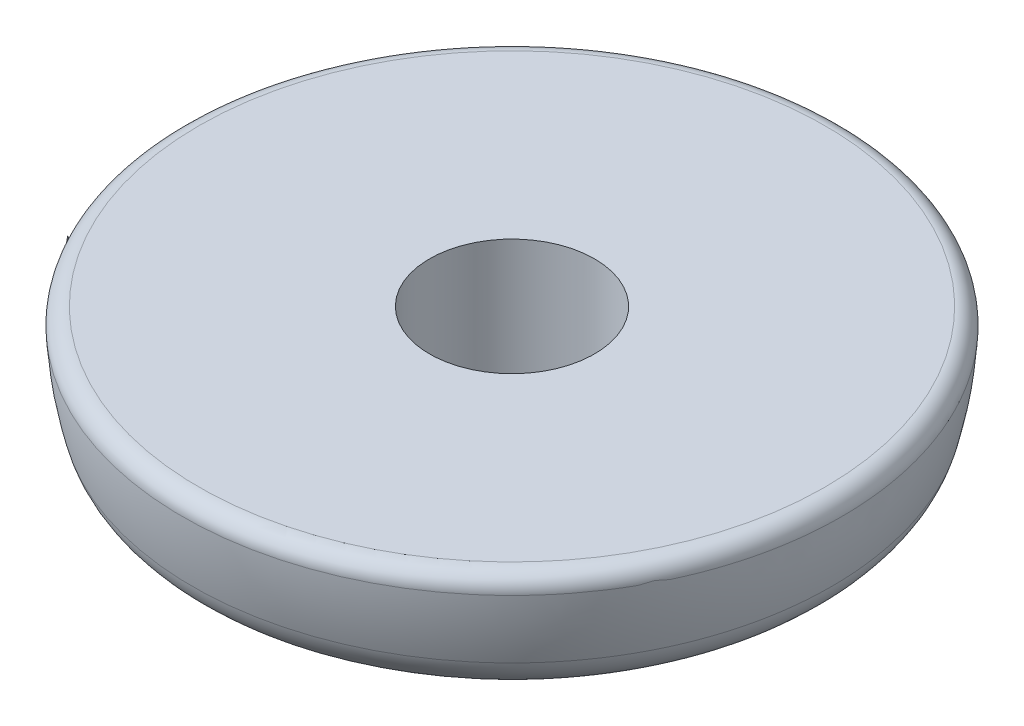
ISO-10303-21;
HEADER;
FILE_DESCRIPTION(('STEP AP214'),'2;1');
FILE_NAME('part.step','',(''),(''),'','','');
FILE_SCHEMA(('AUTOMOTIVE_DESIGN { 1 0 10303 214 1 1 1 1 }'));
ENDSEC;
DATA;
#1=APPLICATION_CONTEXT('core data for automotive mechanical design processes');
#2=APPLICATION_PROTOCOL_DEFINITION('international standard','automotive_design',2000,#1);
#3=PRODUCT_CONTEXT('',#1,'mechanical');
#4=PRODUCT('Part','Part','',(#3));
#5=PRODUCT_RELATED_PRODUCT_CATEGORY('part','',(#4));
#6=PRODUCT_DEFINITION_FORMATION('','',#4);
#7=PRODUCT_DEFINITION_CONTEXT('part definition',#1,'design');
#8=PRODUCT_DEFINITION('design','',#6,#7);
#9=PRODUCT_DEFINITION_SHAPE('','',#8);
#10=(LENGTH_UNIT() NAMED_UNIT(*) SI_UNIT(.MILLI.,.METRE.));
#11=(NAMED_UNIT(*) PLANE_ANGLE_UNIT() SI_UNIT($,.RADIAN.));
#12=(NAMED_UNIT(*) SI_UNIT($,.STERADIAN.) SOLID_ANGLE_UNIT());
#13=UNCERTAINTY_MEASURE_WITH_UNIT(LENGTH_MEASURE(1.E-05),#10,'distance_accuracy_value','');
#14=(GEOMETRIC_REPRESENTATION_CONTEXT(3) GLOBAL_UNCERTAINTY_ASSIGNED_CONTEXT((#13)) GLOBAL_UNIT_ASSIGNED_CONTEXT((#10,
#11,#12)) REPRESENTATION_CONTEXT('',''));
#15=CARTESIAN_POINT('',(0.,0.,0.));
#16=DIRECTION('',(0.,0.,1.));
#17=DIRECTION('',(1.,0.,0.));
#18=AXIS2_PLACEMENT_3D('',#15,#16,#17);
#19=CARTESIAN_POINT('',(0.,-4.276906118832,0.));
#20=DIRECTION('',(0.,-1.,0.));
#21=DIRECTION('',(-1.,0.,0.));
#22=AXIS2_PLACEMENT_3D('',#19,#20,#21);
#23=TOROIDAL_SURFACE('',#22,16.45320862478,3.);
#24=CARTESIAN_POINT('',(0.,-5.03165425744752,0.));
#25=DIRECTION('',(0.,-1.,0.));
#26=DIRECTION('',(-1.,0.,0.));
#27=AXIS2_PLACEMENT_3D('',#24,#25,#26);
#28=CIRCLE('',#27,19.3567160291543);
#29=CARTESIAN_POINT('',(-19.3567160291543,-5.03165425744752,0.));
#30=VERTEX_POINT('',#29);
#31=EDGE_CURVE('E78',#30,#30,#28,.F.);
#32=ORIENTED_EDGE('',*,*,#31,.F.);
#33=EDGE_LOOP('',(#32));
#34=FACE_BOUND('',#33,.T.);
#35=CARTESIAN_POINT('',(0.,-7.20001631318555,0.));
#36=DIRECTION('',(0.,1.,0.));
#37=DIRECTION('',(1.,0.,0.));
#38=AXIS2_PLACEMENT_3D('',#35,#36,#37);
#39=CIRCLE('',#38,17.1280617878194);
#40=CARTESIAN_POINT('',(17.1280617878194,-7.20001631318555,0.));
#41=VERTEX_POINT('',#40);
#42=EDGE_CURVE('E81',#41,#41,#39,.F.);
#43=ORIENTED_EDGE('',*,*,#42,.F.);
#44=EDGE_LOOP('',(#43));
#45=FACE_BOUND('',#44,.T.);
#46=ADVANCED_FACE('F17',(#34,#45),#23,.T.);
#47=CARTESIAN_POINT('',(0.,-7.20001631318555,0.));
#48=DIRECTION('',(0.,1.,0.));
#49=DIRECTION('',(0.,0.,1.));
#50=AXIS2_PLACEMENT_3D('',#47,#48,#49);
#51=CONICAL_SURFACE('',#50,17.1280617878194,1.34390352403538);
#52=ORIENTED_EDGE('',*,*,#42,.T.);
#53=EDGE_LOOP('',(#52));
#54=FACE_BOUND('',#53,.T.);
#55=CARTESIAN_POINT('',(0.,-9.7171977658662,0.));
#56=DIRECTION('',(0.,-1.,0.));
#57=DIRECTION('',(0.99997053715269,0.,0.00767625081400493));
#58=AXIS2_PLACEMENT_3D('',#55,#56,#57);
#59=CIRCLE('',#58,6.22495105434404);
#60=CARTESIAN_POINT('',(6.22476764956162,-9.7171977658662,0.0477842855980493));
#61=VERTEX_POINT('',#60);
#62=EDGE_CURVE('E75',#61,#61,#59,.T.);
#63=ORIENTED_EDGE('',*,*,#62,.F.);
#64=EDGE_LOOP('',(#63));
#65=FACE_BOUND('',#64,.T.);
#66=ADVANCED_FACE('F93',(#54,#65),#51,.T.);
#67=CARTESIAN_POINT('',(0.,0.,0.));
#68=DIRECTION('',(-1.,0.,0.));
#69=DIRECTION('',(0.,0.,-1.));
#70=AXIS2_PLACEMENT_3D('',#67,#68,#69);
#71=SPHERICAL_SURFACE('',#70,20.);
#72=ORIENTED_EDGE('',*,*,#31,.T.);
#73=EDGE_LOOP('',(#72));
#74=FACE_BOUND('',#73,.T.);
#75=CARTESIAN_POINT('',(0.,-1.05263157894689,0.));
#76=DIRECTION('',(0.,-1.,0.));
#77=DIRECTION('',(0.999979997820092,0.,0.00632486835670095));
#78=AXIS2_PLACEMENT_3D('',#75,#76,#77);
#79=CIRCLE('',#78,19.9722799589579);
#80=CARTESIAN_POINT('',(19.971880469821,-1.05263157894689,0.126322041523585));
#81=VERTEX_POINT('',#80);
#82=EDGE_CURVE('E77',#81,#81,#79,.F.);
#83=ORIENTED_EDGE('',*,*,#82,.F.);
#84=EDGE_LOOP('',(#83));
#85=FACE_BOUND('',#84,.T.);
#86=ADVANCED_FACE('F69',(#74,#85),#71,.T.);
#87=CARTESIAN_POINT('',(0.,-8.742827701081,0.));
#88=DIRECTION('',(0.,-1.,0.));
#89=DIRECTION('',(0.99997053715269,0.,0.00767625081400493));
#90=AXIS2_PLACEMENT_3D('',#87,#88,#89);
#91=TOROIDAL_SURFACE('',#90,6.,1.);
#92=CARTESIAN_POINT('',(0.,-8.742827701081,0.));
#93=DIRECTION('',(0.,-1.,0.));
#94=DIRECTION('',(0.,0.,-1.));
#95=AXIS2_PLACEMENT_3D('',#92,#93,#94);
#96=CIRCLE('',#95,5.);
#97=CARTESIAN_POINT('',(0.,-8.742827701081,-5.));
#98=VERTEX_POINT('',#97);
#99=EDGE_CURVE('E41',#98,#98,#96,.F.);
#100=ORIENTED_EDGE('',*,*,#99,.T.);
#101=EDGE_LOOP('',(#100));
#102=FACE_BOUND('',#101,.T.);
#103=ORIENTED_EDGE('',*,*,#62,.T.);
#104=EDGE_LOOP('',(#103));
#105=FACE_BOUND('',#104,.T.);
#106=ADVANCED_FACE('F63',(#102,#105),#91,.T.);
#107=CARTESIAN_POINT('',(0.,-1.,0.));
#108=DIRECTION('',(0.,-1.,0.));
#109=DIRECTION('',(0.999979997820092,0.,0.00632486835670095));
#110=AXIS2_PLACEMENT_3D('',#107,#108,#109);
#111=TOROIDAL_SURFACE('',#110,18.97366596101,1.);
#112=ORIENTED_EDGE('',*,*,#82,.T.);
#113=EDGE_LOOP('',(#112));
#114=FACE_BOUND('',#113,.T.);
#115=CARTESIAN_POINT('',(0.,0.,0.));
#116=DIRECTION('',(0.,-1.,0.));
#117=DIRECTION('',(-1.,0.,0.));
#118=AXIS2_PLACEMENT_3D('',#115,#116,#117);
#119=CIRCLE('',#118,18.97366596101);
#120=CARTESIAN_POINT('',(-18.97366596101,0.,0.));
#121=VERTEX_POINT('',#120);
#122=CARTESIAN_POINT('',(18.97366596101,0.,0.));
#123=VERTEX_POINT('',#122);
#124=EDGE_CURVE('E29',#121,#123,#119,.T.);
#125=ORIENTED_EDGE('',*,*,#124,.T.);
#126=CARTESIAN_POINT('',(0.,0.,0.));
#127=DIRECTION('',(0.,-1.,0.));
#128=DIRECTION('',(1.,0.,0.));
#129=AXIS2_PLACEMENT_3D('',#126,#127,#128);
#130=CIRCLE('',#129,18.97366596101);
#131=EDGE_CURVE('E37',#123,#121,#130,.T.);
#132=ORIENTED_EDGE('',*,*,#131,.T.);
#133=EDGE_LOOP('',(#125,#132));
#134=FACE_BOUND('',#133,.T.);
#135=ADVANCED_FACE('F44',(#114,#134),#111,.T.);
#136=CARTESIAN_POINT('',(0.,0.5,0.));
#137=DIRECTION('',(0.,-1.,0.));
#138=DIRECTION('',(0.,0.,-1.));
#139=AXIS2_PLACEMENT_3D('',#136,#137,#138);
#140=CYLINDRICAL_SURFACE('',#139,5.);
#141=CARTESIAN_POINT('',(0.,0.,0.));
#142=DIRECTION('',(0.,-1.,0.));
#143=DIRECTION('',(0.,0.,-1.));
#144=AXIS2_PLACEMENT_3D('',#141,#142,#143);
#145=CIRCLE('',#144,5.);
#146=CARTESIAN_POINT('',(0.,0.,-5.));
#147=VERTEX_POINT('',#146);
#148=EDGE_CURVE('E11',#147,#147,#145,.F.);
#149=ORIENTED_EDGE('',*,*,#148,.T.);
#150=EDGE_LOOP('',(#149));
#151=FACE_BOUND('',#150,.T.);
#152=ORIENTED_EDGE('',*,*,#99,.F.);
#153=EDGE_LOOP('',(#152));
#154=FACE_BOUND('',#153,.T.);
#155=ADVANCED_FACE('F62',(#151,#154),#140,.F.);
#156=CARTESIAN_POINT('',(0.,0.,0.));
#157=DIRECTION('',(0.,-1.,0.));
#158=DIRECTION('',(0.,0.,-1.));
#159=AXIS2_PLACEMENT_3D('',#156,#157,#158);
#160=PLANE('',#159);
#161=ORIENTED_EDGE('',*,*,#148,.F.);
#162=EDGE_LOOP('',(#161));
#163=FACE_BOUND('',#162,.T.);
#164=ORIENTED_EDGE('',*,*,#131,.F.);
#165=ORIENTED_EDGE('',*,*,#124,.F.);
#166=EDGE_LOOP('',(#164,#165));
#167=FACE_BOUND('',#166,.T.);
#168=ADVANCED_FACE('F39',(#163,#167),#160,.F.);
#169=CLOSED_SHELL('',(#46,#66,#86,#106,#135,#155,#168));
#170=MANIFOLD_SOLID_BREP('B1',#169);
#171=ADVANCED_BREP_SHAPE_REPRESENTATION('',(#18,#170),#14);
#172=SHAPE_DEFINITION_REPRESENTATION(#9,#171);
ENDSEC;
END-ISO-10303-21;
